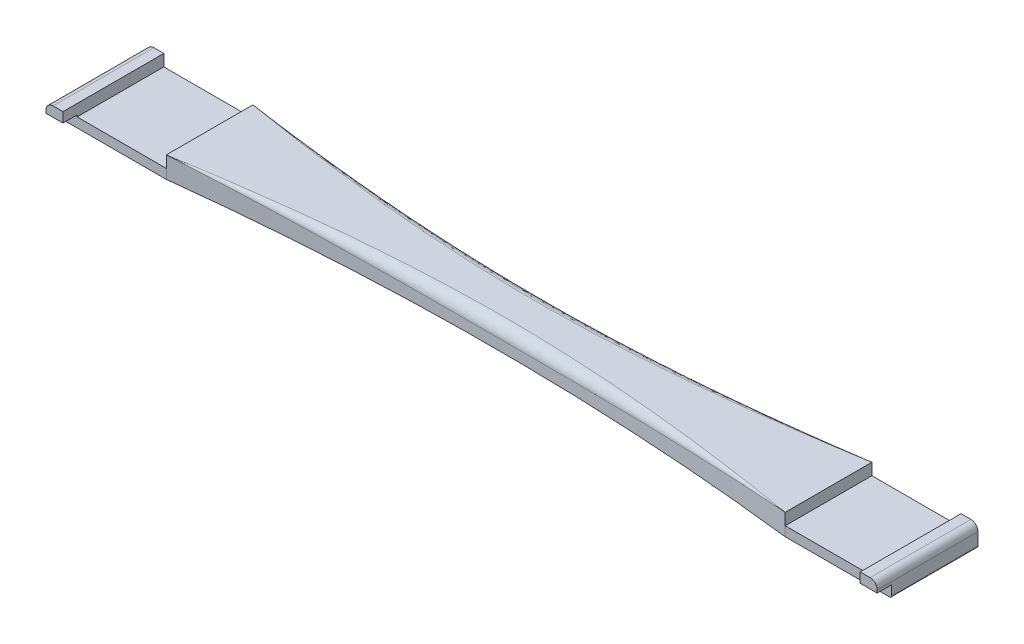
ISO-10303-21;
HEADER;
FILE_DESCRIPTION(('STEP AP214'),'2;1');
FILE_NAME('part.step','',(''),(''),'','','');
FILE_SCHEMA(('AUTOMOTIVE_DESIGN { 1 0 10303 214 1 1 1 1 }'));
ENDSEC;
DATA;
#1=APPLICATION_CONTEXT('core data for automotive mechanical design processes');
#2=APPLICATION_PROTOCOL_DEFINITION('international standard','automotive_design',2000,#1);
#3=PRODUCT_CONTEXT('',#1,'mechanical');
#4=PRODUCT('Part','Part','',(#3));
#5=PRODUCT_RELATED_PRODUCT_CATEGORY('part','',(#4));
#6=PRODUCT_DEFINITION_FORMATION('','',#4);
#7=PRODUCT_DEFINITION_CONTEXT('part definition',#1,'design');
#8=PRODUCT_DEFINITION('design','',#6,#7);
#9=PRODUCT_DEFINITION_SHAPE('','',#8);
#10=(LENGTH_UNIT() NAMED_UNIT(*) SI_UNIT(.MILLI.,.METRE.));
#11=(NAMED_UNIT(*) PLANE_ANGLE_UNIT() SI_UNIT($,.RADIAN.));
#12=(NAMED_UNIT(*) SI_UNIT($,.STERADIAN.) SOLID_ANGLE_UNIT());
#13=UNCERTAINTY_MEASURE_WITH_UNIT(LENGTH_MEASURE(1.E-05),#10,'distance_accuracy_value','');
#14=(GEOMETRIC_REPRESENTATION_CONTEXT(3) GLOBAL_UNCERTAINTY_ASSIGNED_CONTEXT((#13)) GLOBAL_UNIT_ASSIGNED_CONTEXT((#10,
#11,#12)) REPRESENTATION_CONTEXT('',''));
#15=CARTESIAN_POINT('',(0.,0.,0.));
#16=DIRECTION('',(0.,0.,1.));
#17=DIRECTION('',(1.,0.,0.));
#18=AXIS2_PLACEMENT_3D('',#15,#16,#17);
#19=CARTESIAN_POINT('',(0.,2.7,0.));
#20=DIRECTION('',(0.,-1.,0.));
#21=DIRECTION('',(0.,0.,-1.));
#22=AXIS2_PLACEMENT_3D('',#19,#20,#21);
#23=PLANE('',#22);
#24=DIRECTION('',(0.,0.,1.));
#25=VECTOR('',#24,1.);
#26=CARTESIAN_POINT('',(112.7,2.7,-12.25));
#27=LINE('',#26,#25);
#28=CARTESIAN_POINT('',(112.7,2.7,-12.25));
#29=VERTEX_POINT('',#28);
#30=CARTESIAN_POINT('',(112.7,2.7,12.25));
#31=VERTEX_POINT('',#30);
#32=EDGE_CURVE('E556',#29,#31,#27,.T.);
#33=ORIENTED_EDGE('',*,*,#32,.F.);
#34=DIRECTION('',(-1.,0.,0.));
#35=VECTOR('',#34,1.);
#36=CARTESIAN_POINT('',(87.5,2.7,-12.25));
#37=LINE('',#36,#35);
#38=CARTESIAN_POINT('',(87.5,2.7,-12.25));
#39=VERTEX_POINT('',#38);
#40=EDGE_CURVE('E261',#29,#39,#37,.T.);
#41=ORIENTED_EDGE('',*,*,#40,.T.);
#42=DIRECTION('',(0.,0.,1.));
#43=VECTOR('',#42,1.);
#44=CARTESIAN_POINT('',(87.5,2.7,-12.25));
#45=LINE('',#44,#43);
#46=CARTESIAN_POINT('',(87.5,2.7,12.25));
#47=VERTEX_POINT('',#46);
#48=EDGE_CURVE('E264',#39,#47,#45,.T.);
#49=ORIENTED_EDGE('',*,*,#48,.T.);
#50=DIRECTION('',(1.,0.,0.));
#51=VECTOR('',#50,1.);
#52=CARTESIAN_POINT('',(87.5,2.7,12.25));
#53=LINE('',#52,#51);
#54=EDGE_CURVE('E269',#47,#31,#53,.T.);
#55=ORIENTED_EDGE('',*,*,#54,.T.);
#56=EDGE_LOOP('',(#33,#41,#49,#55));
#57=FACE_BOUND('',#56,.T.);
#58=ADVANCED_FACE('F45',(#57),#23,.F.);
#59=CARTESIAN_POINT('',(0.,2.7,0.));
#60=DIRECTION('',(0.,1.,0.));
#61=DIRECTION('',(0.,0.,1.));
#62=AXIS2_PLACEMENT_3D('',#59,#60,#61);
#63=PLANE('',#62);
#64=DIRECTION('',(-1.,0.,0.));
#65=VECTOR('',#64,1.);
#66=CARTESIAN_POINT('',(-87.5000000000001,2.7,-12.25));
#67=LINE('',#66,#65);
#68=CARTESIAN_POINT('',(-87.5000000000001,2.7,-12.25));
#69=VERTEX_POINT('',#68);
#70=CARTESIAN_POINT('',(-112.7,2.7,-12.25));
#71=VERTEX_POINT('',#70);
#72=EDGE_CURVE('E233',#69,#71,#67,.T.);
#73=ORIENTED_EDGE('',*,*,#72,.T.);
#74=DIRECTION('',(0.,0.,1.));
#75=VECTOR('',#74,1.);
#76=CARTESIAN_POINT('',(-112.7,2.7,0.));
#77=LINE('',#76,#75);
#78=CARTESIAN_POINT('',(-112.7,2.7,12.25));
#79=VERTEX_POINT('',#78);
#80=EDGE_CURVE('E302',#71,#79,#77,.T.);
#81=ORIENTED_EDGE('',*,*,#80,.T.);
#82=DIRECTION('',(1.,0.,0.));
#83=VECTOR('',#82,1.);
#84=CARTESIAN_POINT('',(-87.5000000000001,2.7,12.25));
#85=LINE('',#84,#83);
#86=CARTESIAN_POINT('',(-87.5000000000001,2.7,12.25));
#87=VERTEX_POINT('',#86);
#88=EDGE_CURVE('E236',#79,#87,#85,.T.);
#89=ORIENTED_EDGE('',*,*,#88,.T.);
#90=DIRECTION('',(0.,0.,-1.));
#91=VECTOR('',#90,1.);
#92=CARTESIAN_POINT('',(-87.5000000000001,2.7,-12.25));
#93=LINE('',#92,#91);
#94=EDGE_CURVE('E240',#87,#69,#93,.T.);
#95=ORIENTED_EDGE('',*,*,#94,.T.);
#96=EDGE_LOOP('',(#73,#81,#89,#95));
#97=FACE_BOUND('',#96,.T.);
#98=ADVANCED_FACE('F405',(#97),#63,.T.);
#99=CARTESIAN_POINT('',(87.5,6.,12.25));
#100=DIRECTION('',(-1.,0.,0.));
#101=DIRECTION('',(0.,0.,1.));
#102=AXIS2_PLACEMENT_3D('',#99,#100,#101);
#103=PLANE('',#102);
#104=ORIENTED_EDGE('',*,*,#48,.F.);
#105=DIRECTION('',(0.,-1.,0.));
#106=VECTOR('',#105,1.);
#107=CARTESIAN_POINT('',(87.5,6.,-12.25));
#108=LINE('',#107,#106);
#109=CARTESIAN_POINT('',(87.5,6.,-12.25));
#110=VERTEX_POINT('',#109);
#111=EDGE_CURVE('E379',#110,#39,#108,.T.);
#112=ORIENTED_EDGE('',*,*,#111,.F.);
#113=DIRECTION('',(0.,0.,-1.));
#114=VECTOR('',#113,1.);
#115=CARTESIAN_POINT('',(87.5,6.,12.25));
#116=LINE('',#115,#114);
#117=CARTESIAN_POINT('',(87.5,6.,12.25));
#118=VERTEX_POINT('',#117);
#119=EDGE_CURVE('E342',#118,#110,#116,.T.);
#120=ORIENTED_EDGE('',*,*,#119,.F.);
#121=DIRECTION('',(0.,-1.,0.));
#122=VECTOR('',#121,1.);
#123=CARTESIAN_POINT('',(87.5,6.,12.25));
#124=LINE('',#123,#122);
#125=EDGE_CURVE('E374',#118,#47,#124,.T.);
#126=ORIENTED_EDGE('',*,*,#125,.T.);
#127=EDGE_LOOP('',(#104,#112,#120,#126));
#128=FACE_BOUND('',#127,.T.);
#129=ADVANCED_FACE('F402',(#128),#103,.F.);
#130=CARTESIAN_POINT('',(-87.5,6.,12.25));
#131=DIRECTION('',(-1.,0.,0.));
#132=DIRECTION('',(0.,0.,1.));
#133=AXIS2_PLACEMENT_3D('',#130,#131,#132);
#134=PLANE('',#133);
#135=ORIENTED_EDGE('',*,*,#94,.F.);
#136=DIRECTION('',(0.,-1.,0.));
#137=VECTOR('',#136,1.);
#138=CARTESIAN_POINT('',(-87.5000000000001,6.,12.25));
#139=LINE('',#138,#137);
#140=CARTESIAN_POINT('',(-87.5000000000001,6.,12.25));
#141=VERTEX_POINT('',#140);
#142=EDGE_CURVE('E307',#141,#87,#139,.T.);
#143=ORIENTED_EDGE('',*,*,#142,.F.);
#144=DIRECTION('',(0.,0.,-1.));
#145=VECTOR('',#144,1.);
#146=CARTESIAN_POINT('',(-87.5,6.,12.25));
#147=LINE('',#146,#145);
#148=CARTESIAN_POINT('',(-87.5000000000001,6.,-12.25));
#149=VERTEX_POINT('',#148);
#150=EDGE_CURVE('E301',#141,#149,#147,.T.);
#151=ORIENTED_EDGE('',*,*,#150,.T.);
#152=DIRECTION('',(0.,-1.,0.));
#153=VECTOR('',#152,1.);
#154=CARTESIAN_POINT('',(-87.5000000000001,6.,-12.25));
#155=LINE('',#154,#153);
#156=EDGE_CURVE('E883',#149,#69,#155,.T.);
#157=ORIENTED_EDGE('',*,*,#156,.T.);
#158=EDGE_LOOP('',(#135,#143,#151,#157));
#159=FACE_BOUND('',#158,.T.);
#160=ADVANCED_FACE('F401',(#159),#134,.T.);
#161=CARTESIAN_POINT('',(0.,6.,757.128345771979));
#162=DIRECTION('',(0.,-1.,0.));
#163=DIRECTION('',(0.,0.,-1.));
#164=AXIS2_PLACEMENT_3D('',#161,#162,#163);
#165=CYLINDRICAL_SURFACE('',#164,750.);
#166=ORIENTED_EDGE('',*,*,#125,.F.);
#167=CARTESIAN_POINT('',(-87.5000000000001,6.,12.25));
#168=CARTESIAN_POINT('',(-72.983193556157,5.24999993309472,10.5447274933602));
#169=CARTESIAN_POINT('',(-58.4165276942769,4.49999999996609,9.26394972299534));
#170=CARTESIAN_POINT('',(-36.5290600631975,3.65625000001708,7.98280639575663));
#171=CARTESIAN_POINT('',(-29.2269951686637,3.42187499998212,7.66240648600781));
#172=CARTESIAN_POINT('',(-14.6166200938381,3.09375000001833,7.2351761715188));
#173=CARTESIAN_POINT('',(-7.30831009206505,2.99999999999861,7.12834577197894));
#174=CARTESIAN_POINT('',(7.30831009207044,3.00000000000178,7.12834577197899));
#175=CARTESIAN_POINT('',(14.6166200938449,3.09375000001824,7.23517617151894));
#176=CARTESIAN_POINT('',(29.2269951686486,3.42187499998203,7.66240648600722));
#177=CARTESIAN_POINT('',(36.5290600632156,3.65625000001718,7.98280639575762));
#178=CARTESIAN_POINT('',(58.4165276942484,4.49999999996619,9.26394972299367));
#179=CARTESIAN_POINT('',(72.9831935561807,5.24999993310629,10.544727493363));
#180=CARTESIAN_POINT('',(87.5,6.,12.25));
#181=(BOUNDED_CURVE() B_SPLINE_CURVE(3,(#167,#168,#169,#170,#171,#172,#173,#174,#175,#176,#177,
#178,#179,#180),.UNSPECIFIED.,.F.,.F.) B_SPLINE_CURVE_WITH_KNOTS((4,2,2,2,2,2,4),
(6.16625234571721,6.2247188264484,6.25395206681399,6.28318530717959,6.31241854754518,
6.34165178791078,6.40011826864196),
.UNSPECIFIED.) CURVE() GEOMETRIC_REPRESENTATION_ITEM() RATIONAL_B_SPLINE_CURVE((0.999999999999973,
0.999999999999973,0.999999999999973,0.999999999999973,0.999999999999973,0.999999999999973,
0.999999999999973,0.999999999999973,0.999999999999973,0.999999999999973,0.999999999999973,
0.999999999999973,0.999999999999973,0.999999999999973)) REPRESENTATION_ITEM(''));
#182=EDGE_CURVE('E385',#118,#141,#181,.F.);
#183=ORIENTED_EDGE('',*,*,#182,.T.);
#184=ORIENTED_EDGE('',*,*,#142,.T.);
#185=DIRECTION('',(0.,-1.,0.));
#186=VECTOR('',#185,1.);
#187=CARTESIAN_POINT('',(-87.5000000000001,2.7,12.25));
#188=LINE('',#187,#186);
#189=CARTESIAN_POINT('',(-87.5000000000001,0.,12.25));
#190=VERTEX_POINT('',#189);
#191=EDGE_CURVE('E250',#87,#190,#188,.T.);
#192=ORIENTED_EDGE('',*,*,#191,.T.);
#193=CARTESIAN_POINT('',(0.,0.,757.128345771979));
#194=DIRECTION('',(0.,-1.,0.));
#195=DIRECTION('',(0.,0.,-1.));
#196=AXIS2_PLACEMENT_3D('',#193,#194,#195);
#197=CIRCLE('',#196,750.);
#198=CARTESIAN_POINT('',(87.5,0.,12.25));
#199=VERTEX_POINT('',#198);
#200=EDGE_CURVE('E298',#190,#199,#197,.T.);
#201=ORIENTED_EDGE('',*,*,#200,.T.);
#202=DIRECTION('',(0.,-1.,0.));
#203=VECTOR('',#202,1.);
#204=CARTESIAN_POINT('',(87.5,2.7,12.25));
#205=LINE('',#204,#203);
#206=EDGE_CURVE('E286',#47,#199,#205,.T.);
#207=ORIENTED_EDGE('',*,*,#206,.F.);
#208=EDGE_LOOP('',(#166,#183,#184,#192,#201,#207));
#209=FACE_BOUND('',#208,.T.);
#210=ADVANCED_FACE('F392',(#209),#165,.F.);
#211=CARTESIAN_POINT('',(0.,6.,-757.128345771979));
#212=DIRECTION('',(0.,-1.,0.));
#213=DIRECTION('',(0.,0.,-1.));
#214=AXIS2_PLACEMENT_3D('',#211,#212,#213);
#215=CYLINDRICAL_SURFACE('',#214,750.);
#216=ORIENTED_EDGE('',*,*,#156,.F.);
#217=CARTESIAN_POINT('',(87.5,6.,-12.25));
#218=CARTESIAN_POINT('',(72.9831935561489,5.24999993299477,-10.5447274933593));
#219=CARTESIAN_POINT('',(58.4165276942991,4.49999999996609,-9.26394972299604));
#220=CARTESIAN_POINT('',(36.5290600631904,3.65625000001703,-7.98280639575645));
#221=CARTESIAN_POINT('',(29.2269951686362,3.42187499998186,-7.66240648600662));
#222=CARTESIAN_POINT('',(14.6166200938575,3.09375000001805,-7.23517617151955));
#223=CARTESIAN_POINT('',(7.30831009139927,3.00000000000158,-7.12834577197876));
#224=CARTESIAN_POINT('',(-7.3083100913937,2.99999999999842,-7.12834577197916));
#225=CARTESIAN_POINT('',(-14.6166200938379,3.09375000001814,-7.23517617151806));
#226=CARTESIAN_POINT('',(-29.2269951686634,3.42187499998195,-7.66240648600853));
#227=CARTESIAN_POINT('',(-36.529060063223,3.65625000001693,-7.98280639575713));
#228=CARTESIAN_POINT('',(-58.4165276942253,4.49999999996599,-9.26394972299427));
#229=CARTESIAN_POINT('',(-72.9831935561799,5.24999993338415,-10.5447274933629));
#230=CARTESIAN_POINT('',(-87.5000000000001,6.,-12.25));
#231=(BOUNDED_CURVE() B_SPLINE_CURVE(3,(#217,#218,#219,#220,#221,#222,#223,#224,#225,#226,#227,
#228,#229,#230),.UNSPECIFIED.,.F.,.F.) B_SPLINE_CURVE_WITH_KNOTS((4,2,2,2,2,2,4),
(6.16625234571721,6.2247188264484,6.25395206681399,6.28318530717959,6.31241854754518,
6.34165178791078,6.40011826864196),
.UNSPECIFIED.) CURVE() GEOMETRIC_REPRESENTATION_ITEM() RATIONAL_B_SPLINE_CURVE((1.,1.,1.,1.,1.,
1.,1.,1.,1.,1.,1.,1.,1.,1.)) REPRESENTATION_ITEM(''));
#232=EDGE_CURVE('E487',#149,#110,#231,.F.);
#233=ORIENTED_EDGE('',*,*,#232,.T.);
#234=ORIENTED_EDGE('',*,*,#111,.T.);
#235=DIRECTION('',(0.,-1.,0.));
#236=VECTOR('',#235,1.);
#237=CARTESIAN_POINT('',(87.5,2.7,-12.25));
#238=LINE('',#237,#236);
#239=CARTESIAN_POINT('',(87.5,0.,-12.25));
#240=VERTEX_POINT('',#239);
#241=EDGE_CURVE('E290',#39,#240,#238,.T.);
#242=ORIENTED_EDGE('',*,*,#241,.T.);
#243=CARTESIAN_POINT('',(0.,0.,-757.128345771979));
#244=DIRECTION('',(0.,1.,0.));
#245=DIRECTION('',(0.,0.,1.));
#246=AXIS2_PLACEMENT_3D('',#243,#244,#245);
#247=CIRCLE('',#246,750.);
#248=CARTESIAN_POINT('',(-87.5000000000001,0.,-12.25));
#249=VERTEX_POINT('',#248);
#250=EDGE_CURVE('E294',#249,#240,#247,.T.);
#251=ORIENTED_EDGE('',*,*,#250,.F.);
#252=DIRECTION('',(0.,-1.,0.));
#253=VECTOR('',#252,1.);
#254=CARTESIAN_POINT('',(-87.5000000000001,2.7,-12.25));
#255=LINE('',#254,#253);
#256=EDGE_CURVE('E243',#69,#249,#255,.T.);
#257=ORIENTED_EDGE('',*,*,#256,.F.);
#258=EDGE_LOOP('',(#216,#233,#234,#242,#251,#257));
#259=FACE_BOUND('',#258,.T.);
#260=ADVANCED_FACE('F355',(#259),#215,.F.);
#261=CARTESIAN_POINT('',(0.,6.,-757.128345771979));
#262=DIRECTION('',(0.,1.,0.));
#263=DIRECTION('',(0.,0.,1.));
#264=AXIS2_PLACEMENT_3D('',#261,#262,#263);
#265=PLANE('',#264);
#266=ORIENTED_EDGE('',*,*,#150,.F.);
#267=CARTESIAN_POINT('',(87.5,6.,12.25));
#268=CARTESIAN_POINT('',(73.0720434443471,6.,9.80007829553897));
#269=CARTESIAN_POINT('',(58.5443044834947,6.00000000000002,7.76886150223446));
#270=CARTESIAN_POINT('',(36.6459493093459,5.99999999999999,5.6418867282853));
#271=CARTESIAN_POINT('',(29.3290609742949,5.99999999999999,5.08616404855593));
#272=CARTESIAN_POINT('',(14.6748575065022,6.00000000000001,4.32938686710422));
#273=CARTESIAN_POINT('',(7.33754333243302,6.,4.12834577197896));
#274=CARTESIAN_POINT('',(-7.33754333242761,6.,4.12834577197896));
#275=CARTESIAN_POINT('',(-14.674857506481,5.99999999999999,4.32938686791583));
#276=CARTESIAN_POINT('',(-29.3290609743243,6.00000000000001,5.08616404774477));
#277=CARTESIAN_POINT('',(-36.6459493093433,5.99999999999999,5.64188672828507));
#278=CARTESIAN_POINT('',(-58.5443044834922,6.00000000000003,7.76886150223423));
#279=CARTESIAN_POINT('',(-73.0720434443517,6.,9.80007829550529));
#280=CARTESIAN_POINT('',(-87.5000000000001,6.,12.25));
#281=(BOUNDED_CURVE() B_SPLINE_CURVE(3,(#267,#268,#269,#270,#271,#272,#273,#274,#275,#276,#277,
#278,#279,#280),.UNSPECIFIED.,.F.,.F.) B_SPLINE_CURVE_WITH_KNOTS((4,2,2,2,2,2,4),
(6.16625234571721,6.2247188264484,6.25395206681399,6.28318530717959,6.31241854754518,
6.34165178791078,6.40011826864196),
.UNSPECIFIED.) CURVE() GEOMETRIC_REPRESENTATION_ITEM() RATIONAL_B_SPLINE_CURVE((1.,1.,1.,1.,1.,
1.,1.,1.,1.,1.,1.,1.,1.,1.)) REPRESENTATION_ITEM(''));
#282=EDGE_CURVE('E423',#141,#118,#281,.F.);
#283=ORIENTED_EDGE('',*,*,#282,.T.);
#284=ORIENTED_EDGE('',*,*,#119,.T.);
#285=CARTESIAN_POINT('',(-87.5000000000001,6.,-12.25));
#286=CARTESIAN_POINT('',(-73.0720434443517,6.,-9.80007829550534));
#287=CARTESIAN_POINT('',(-58.5443044834922,6.00000000000003,-7.76886150223433));
#288=CARTESIAN_POINT('',(-36.6459493093433,5.99999999999999,-5.64188672828523));
#289=CARTESIAN_POINT('',(-29.3290609743243,6.00000000000001,-5.08616404774494));
#290=CARTESIAN_POINT('',(-14.674857506481,5.99999999999999,-4.32938686791602));
#291=CARTESIAN_POINT('',(-7.33754333242761,6.,-4.12834577197916));
#292=CARTESIAN_POINT('',(7.33754333243302,6.,-4.12834577197916));
#293=CARTESIAN_POINT('',(14.6748575065022,6.00000000000001,-4.32938686710441));
#294=CARTESIAN_POINT('',(29.3290609742948,5.99999999999999,-5.0861640485561));
#295=CARTESIAN_POINT('',(36.6459493093459,5.99999999999999,-5.64188672828545));
#296=CARTESIAN_POINT('',(58.5443044834947,6.00000000000002,-7.76886150223455));
#297=CARTESIAN_POINT('',(73.0720434443471,6.,-9.80007829553902));
#298=CARTESIAN_POINT('',(87.5,6.,-12.25));
#299=(BOUNDED_CURVE() B_SPLINE_CURVE(3,(#285,#286,#287,#288,#289,#290,#291,#292,#293,#294,#295,
#296,#297,#298),.UNSPECIFIED.,.F.,.F.) B_SPLINE_CURVE_WITH_KNOTS((4,2,2,2,2,2,4),
(6.16625234571721,6.2247188264484,6.25395206681399,6.28318530717959,6.31241854754518,
6.34165178791078,6.40011826864196),
.UNSPECIFIED.) CURVE() GEOMETRIC_REPRESENTATION_ITEM() RATIONAL_B_SPLINE_CURVE((0.999999999999973,
0.999999999999973,0.999999999999973,0.999999999999973,0.999999999999973,0.999999999999973,
0.999999999999973,0.999999999999973,0.999999999999973,0.999999999999973,0.999999999999973,
0.999999999999973,0.999999999999973,0.999999999999973)) REPRESENTATION_ITEM(''));
#300=EDGE_CURVE('E332',#110,#149,#299,.F.);
#301=ORIENTED_EDGE('',*,*,#300,.T.);
#302=EDGE_LOOP('',(#266,#283,#284,#301));
#303=FACE_BOUND('',#302,.T.);
#304=ADVANCED_FACE('F344',(#303),#265,.T.);
#305=CARTESIAN_POINT('',(0.,0.,-757.128345771979));
#306=DIRECTION('',(0.,1.,0.));
#307=DIRECTION('',(0.,0.,1.));
#308=AXIS2_PLACEMENT_3D('',#305,#306,#307);
#309=PLANE('',#308);
#310=DIRECTION('',(1.,0.,0.));
#311=VECTOR('',#310,1.);
#312=CARTESIAN_POINT('',(-87.5000000000001,0.,12.25));
#313=LINE('',#312,#311);
#314=CARTESIAN_POINT('',(-117.,0.,12.25));
#315=VERTEX_POINT('',#314);
#316=EDGE_CURVE('E227',#315,#190,#313,.T.);
#317=ORIENTED_EDGE('',*,*,#316,.F.);
#318=DIRECTION('',(0.,0.,1.));
#319=VECTOR('',#318,1.);
#320=CARTESIAN_POINT('',(-117.,0.,-757.128345771979));
#321=LINE('',#320,#319);
#322=CARTESIAN_POINT('',(-117.,0.,-12.25));
#323=VERTEX_POINT('',#322);
#324=EDGE_CURVE('E514',#315,#323,#321,.F.);
#325=ORIENTED_EDGE('',*,*,#324,.T.);
#326=DIRECTION('',(-1.,0.,0.));
#327=VECTOR('',#326,1.);
#328=CARTESIAN_POINT('',(-87.5000000000001,0.,-12.25));
#329=LINE('',#328,#327);
#330=EDGE_CURVE('E221',#249,#323,#329,.T.);
#331=ORIENTED_EDGE('',*,*,#330,.F.);
#332=ORIENTED_EDGE('',*,*,#250,.T.);
#333=DIRECTION('',(-1.,0.,0.));
#334=VECTOR('',#333,1.);
#335=CARTESIAN_POINT('',(87.5,0.,-12.25));
#336=LINE('',#335,#334);
#337=CARTESIAN_POINT('',(117.,0.,-12.25));
#338=VERTEX_POINT('',#337);
#339=EDGE_CURVE('E260',#338,#240,#336,.T.);
#340=ORIENTED_EDGE('',*,*,#339,.F.);
#341=DIRECTION('',(0.,0.,-1.));
#342=VECTOR('',#341,1.);
#343=CARTESIAN_POINT('',(117.,0.,-757.128345771979));
#344=LINE('',#343,#342);
#345=CARTESIAN_POINT('',(117.,0.,12.25));
#346=VERTEX_POINT('',#345);
#347=EDGE_CURVE('E511',#338,#346,#344,.F.);
#348=ORIENTED_EDGE('',*,*,#347,.T.);
#349=DIRECTION('',(1.,0.,0.));
#350=VECTOR('',#349,1.);
#351=CARTESIAN_POINT('',(87.5,0.,12.25));
#352=LINE('',#351,#350);
#353=EDGE_CURVE('E265',#199,#346,#352,.T.);
#354=ORIENTED_EDGE('',*,*,#353,.F.);
#355=ORIENTED_EDGE('',*,*,#200,.F.);
#356=EDGE_LOOP('',(#317,#325,#331,#332,#340,#348,#354,#355));
#357=FACE_BOUND('',#356,.T.);
#358=ADVANCED_FACE('F354',(#357),#309,.F.);
#359=CARTESIAN_POINT('',(87.5,2.7,-12.25));
#360=DIRECTION('',(0.,0.,1.));
#361=DIRECTION('',(1.,0.,0.));
#362=AXIS2_PLACEMENT_3D('',#359,#360,#361);
#363=PLANE('',#362);
#364=DIRECTION('',(0.,-1.,0.));
#365=VECTOR('',#364,1.);
#366=CARTESIAN_POINT('',(117.5,2.7,-12.25));
#367=LINE('',#366,#365);
#368=CARTESIAN_POINT('',(117.5,4.,-12.25));
#369=VERTEX_POINT('',#368);
#370=CARTESIAN_POINT('',(117.5,0.500000000000001,-12.25));
#371=VERTEX_POINT('',#370);
#372=EDGE_CURVE('E273',#369,#371,#367,.T.);
#373=ORIENTED_EDGE('',*,*,#372,.T.);
#374=CARTESIAN_POINT('',(117.,0.5,-12.25));
#375=DIRECTION('',(0.,0.,1.));
#376=DIRECTION('',(1.,0.,0.));
#377=AXIS2_PLACEMENT_3D('',#374,#375,#376);
#378=CIRCLE('',#377,0.5);
#379=EDGE_CURVE('E524',#371,#338,#378,.F.);
#380=ORIENTED_EDGE('',*,*,#379,.T.);
#381=ORIENTED_EDGE('',*,*,#339,.T.);
#382=ORIENTED_EDGE('',*,*,#241,.F.);
#383=ORIENTED_EDGE('',*,*,#40,.F.);
#384=DIRECTION('',(0.,-1.,0.));
#385=VECTOR('',#384,1.);
#386=CARTESIAN_POINT('',(112.7,6.,-12.25));
#387=LINE('',#386,#385);
#388=CARTESIAN_POINT('',(112.7,6.,-12.25));
#389=VERTEX_POINT('',#388);
#390=EDGE_CURVE('E550',#389,#29,#387,.T.);
#391=ORIENTED_EDGE('',*,*,#390,.F.);
#392=DIRECTION('',(-1.,0.,0.));
#393=VECTOR('',#392,1.);
#394=CARTESIAN_POINT('',(117.5,6.,-12.25));
#395=LINE('',#394,#393);
#396=CARTESIAN_POINT('',(115.5,6.,-12.25));
#397=VERTEX_POINT('',#396);
#398=EDGE_CURVE('E605',#397,#389,#395,.T.);
#399=ORIENTED_EDGE('',*,*,#398,.F.);
#400=CARTESIAN_POINT('',(115.5,4.,-12.25));
#401=DIRECTION('',(0.,0.,1.));
#402=DIRECTION('',(1.,0.,0.));
#403=AXIS2_PLACEMENT_3D('',#400,#401,#402);
#404=CIRCLE('',#403,2.);
#405=EDGE_CURVE('E323',#397,#369,#404,.F.);
#406=ORIENTED_EDGE('',*,*,#405,.T.);
#407=EDGE_LOOP('',(#373,#380,#381,#382,#383,#391,#399,#406));
#408=FACE_BOUND('',#407,.T.);
#409=ADVANCED_FACE('F356',(#408),#363,.F.);
#410=CARTESIAN_POINT('',(87.5,2.7,12.25));
#411=DIRECTION('',(0.,0.,-1.));
#412=DIRECTION('',(-1.,0.,0.));
#413=AXIS2_PLACEMENT_3D('',#410,#411,#412);
#414=PLANE('',#413);
#415=ORIENTED_EDGE('',*,*,#353,.T.);
#416=CARTESIAN_POINT('',(117.,0.5,12.25));
#417=DIRECTION('',(0.,0.,-1.));
#418=DIRECTION('',(-1.,0.,0.));
#419=AXIS2_PLACEMENT_3D('',#416,#417,#418);
#420=CIRCLE('',#419,0.5);
#421=CARTESIAN_POINT('',(117.5,0.500000000000001,12.25));
#422=VERTEX_POINT('',#421);
#423=EDGE_CURVE('E527',#346,#422,#420,.F.);
#424=ORIENTED_EDGE('',*,*,#423,.T.);
#425=DIRECTION('',(0.,-1.,0.));
#426=VECTOR('',#425,1.);
#427=CARTESIAN_POINT('',(117.5,2.7,12.25));
#428=LINE('',#427,#426);
#429=CARTESIAN_POINT('',(117.5,3.2,12.25));
#430=VERTEX_POINT('',#429);
#431=EDGE_CURVE('E282',#430,#422,#428,.T.);
#432=ORIENTED_EDGE('',*,*,#431,.F.);
#433=DIRECTION('',(1.,0.,0.));
#434=VECTOR('',#433,1.);
#435=CARTESIAN_POINT('',(-117.5,3.2,12.25));
#436=LINE('',#435,#434);
#437=CARTESIAN_POINT('',(112.7,3.2,12.25));
#438=VERTEX_POINT('',#437);
#439=EDGE_CURVE('E623',#438,#430,#436,.T.);
#440=ORIENTED_EDGE('',*,*,#439,.F.);
#441=DIRECTION('',(0.,1.,0.));
#442=VECTOR('',#441,1.);
#443=CARTESIAN_POINT('',(112.7,6.,12.25));
#444=LINE('',#443,#442);
#445=EDGE_CURVE('E12',#31,#438,#444,.T.);
#446=ORIENTED_EDGE('',*,*,#445,.F.);
#447=ORIENTED_EDGE('',*,*,#54,.F.);
#448=ORIENTED_EDGE('',*,*,#206,.T.);
#449=EDGE_LOOP('',(#415,#424,#432,#440,#446,#447,#448));
#450=FACE_BOUND('',#449,.T.);
#451=ADVANCED_FACE('F598',(#450),#414,.F.);
#452=CARTESIAN_POINT('',(117.5,2.7,-12.25));
#453=DIRECTION('',(-1.,0.,0.));
#454=DIRECTION('',(0.,0.,1.));
#455=AXIS2_PLACEMENT_3D('',#452,#453,#454);
#456=PLANE('',#455);
#457=DIRECTION('',(0.,0.,1.));
#458=VECTOR('',#457,1.);
#459=CARTESIAN_POINT('',(117.5,3.2,12.25));
#460=LINE('',#459,#458);
#461=CARTESIAN_POINT('',(117.5,3.2,16.25));
#462=VERTEX_POINT('',#461);
#463=EDGE_CURVE('E69',#430,#462,#460,.T.);
#464=ORIENTED_EDGE('',*,*,#463,.F.);
#465=ORIENTED_EDGE('',*,*,#431,.T.);
#466=DIRECTION('',(0.,0.,-1.));
#467=VECTOR('',#466,1.);
#468=CARTESIAN_POINT('',(117.5,0.5,-12.25));
#469=LINE('',#468,#467);
#470=EDGE_CURVE('E520',#422,#371,#469,.T.);
#471=ORIENTED_EDGE('',*,*,#470,.T.);
#472=ORIENTED_EDGE('',*,*,#372,.F.);
#473=DIRECTION('',(0.,0.,-1.));
#474=VECTOR('',#473,1.);
#475=CARTESIAN_POINT('',(117.5,4.,-12.25));
#476=LINE('',#475,#474);
#477=CARTESIAN_POINT('',(117.5,4.,16.25));
#478=VERTEX_POINT('',#477);
#479=EDGE_CURVE('E326',#369,#478,#476,.F.);
#480=ORIENTED_EDGE('',*,*,#479,.T.);
#481=DIRECTION('',(0.,-1.,0.));
#482=VECTOR('',#481,1.);
#483=CARTESIAN_POINT('',(117.5,6.,16.25));
#484=LINE('',#483,#482);
#485=EDGE_CURVE('E535',#478,#462,#484,.T.);
#486=ORIENTED_EDGE('',*,*,#485,.T.);
#487=EDGE_LOOP('',(#464,#465,#471,#472,#480,#486));
#488=FACE_BOUND('',#487,.T.);
#489=ADVANCED_FACE('F542',(#488),#456,.F.);
#490=CARTESIAN_POINT('',(-87.5000000000001,2.7,-12.25));
#491=DIRECTION('',(0.,0.,1.));
#492=DIRECTION('',(1.,0.,0.));
#493=AXIS2_PLACEMENT_3D('',#490,#491,#492);
#494=PLANE('',#493);
#495=ORIENTED_EDGE('',*,*,#330,.T.);
#496=CARTESIAN_POINT('',(-117.,0.5,-12.25));
#497=DIRECTION('',(0.,0.,1.));
#498=DIRECTION('',(1.,0.,0.));
#499=AXIS2_PLACEMENT_3D('',#496,#497,#498);
#500=CIRCLE('',#499,0.5);
#501=CARTESIAN_POINT('',(-117.5,0.500000000000001,-12.25));
#502=VERTEX_POINT('',#501);
#503=EDGE_CURVE('E517',#323,#502,#500,.F.);
#504=ORIENTED_EDGE('',*,*,#503,.T.);
#505=DIRECTION('',(0.,-1.,0.));
#506=VECTOR('',#505,1.);
#507=CARTESIAN_POINT('',(-117.5,2.7,-12.25));
#508=LINE('',#507,#506);
#509=CARTESIAN_POINT('',(-117.5,4.,-12.25));
#510=VERTEX_POINT('',#509);
#511=EDGE_CURVE('E256',#510,#502,#508,.T.);
#512=ORIENTED_EDGE('',*,*,#511,.F.);
#513=CARTESIAN_POINT('',(-115.5,4.,-12.25));
#514=DIRECTION('',(0.,0.,1.));
#515=DIRECTION('',(1.,0.,0.));
#516=AXIS2_PLACEMENT_3D('',#513,#514,#515);
#517=CIRCLE('',#516,2.);
#518=CARTESIAN_POINT('',(-115.5,6.,-12.25));
#519=VERTEX_POINT('',#518);
#520=EDGE_CURVE('E316',#510,#519,#517,.F.);
#521=ORIENTED_EDGE('',*,*,#520,.T.);
#522=DIRECTION('',(-1.,0.,0.));
#523=VECTOR('',#522,1.);
#524=CARTESIAN_POINT('',(-117.5,6.,-12.25));
#525=LINE('',#524,#523);
#526=CARTESIAN_POINT('',(-112.7,6.,-12.25));
#527=VERTEX_POINT('',#526);
#528=EDGE_CURVE('E567',#527,#519,#525,.T.);
#529=ORIENTED_EDGE('',*,*,#528,.F.);
#530=DIRECTION('',(0.,-1.,0.));
#531=VECTOR('',#530,1.);
#532=CARTESIAN_POINT('',(-112.7,6.,-12.25));
#533=LINE('',#532,#531);
#534=EDGE_CURVE('E229',#527,#71,#533,.T.);
#535=ORIENTED_EDGE('',*,*,#534,.T.);
#536=ORIENTED_EDGE('',*,*,#72,.F.);
#537=ORIENTED_EDGE('',*,*,#256,.T.);
#538=EDGE_LOOP('',(#495,#504,#512,#521,#529,#535,#536,#537));
#539=FACE_BOUND('',#538,.T.);
#540=ADVANCED_FACE('F576',(#539),#494,.F.);
#541=CARTESIAN_POINT('',(-117.5,2.7,-12.25));
#542=DIRECTION('',(1.,0.,0.));
#543=DIRECTION('',(0.,0.,-1.));
#544=AXIS2_PLACEMENT_3D('',#541,#542,#543);
#545=PLANE('',#544);
#546=DIRECTION('',(0.,-1.,0.));
#547=VECTOR('',#546,1.);
#548=CARTESIAN_POINT('',(-117.5,2.7,12.25));
#549=LINE('',#548,#547);
#550=CARTESIAN_POINT('',(-117.5,3.2,12.25));
#551=VERTEX_POINT('',#550);
#552=CARTESIAN_POINT('',(-117.5,0.500000000000001,12.25));
#553=VERTEX_POINT('',#552);
#554=EDGE_CURVE('E214',#551,#553,#549,.T.);
#555=ORIENTED_EDGE('',*,*,#554,.F.);
#556=DIRECTION('',(0.,0.,1.));
#557=VECTOR('',#556,1.);
#558=CARTESIAN_POINT('',(-117.5,3.2,12.25));
#559=LINE('',#558,#557);
#560=CARTESIAN_POINT('',(-117.5,3.2,16.25));
#561=VERTEX_POINT('',#560);
#562=EDGE_CURVE('E198',#551,#561,#559,.T.);
#563=ORIENTED_EDGE('',*,*,#562,.T.);
#564=DIRECTION('',(0.,-1.,0.));
#565=VECTOR('',#564,1.);
#566=CARTESIAN_POINT('',(-117.5,6.,16.25));
#567=LINE('',#566,#565);
#568=CARTESIAN_POINT('',(-117.5,4.,16.25));
#569=VERTEX_POINT('',#568);
#570=EDGE_CURVE('E210',#569,#561,#567,.T.);
#571=ORIENTED_EDGE('',*,*,#570,.F.);
#572=DIRECTION('',(0.,0.,1.));
#573=VECTOR('',#572,1.);
#574=CARTESIAN_POINT('',(-117.5,4.,-12.25));
#575=LINE('',#574,#573);
#576=EDGE_CURVE('E313',#569,#510,#575,.F.);
#577=ORIENTED_EDGE('',*,*,#576,.T.);
#578=ORIENTED_EDGE('',*,*,#511,.T.);
#579=DIRECTION('',(0.,0.,1.));
#580=VECTOR('',#579,1.);
#581=CARTESIAN_POINT('',(-117.5,0.5,-12.25));
#582=LINE('',#581,#580);
#583=EDGE_CURVE('E500',#502,#553,#582,.T.);
#584=ORIENTED_EDGE('',*,*,#583,.T.);
#585=EDGE_LOOP('',(#555,#563,#571,#577,#578,#584));
#586=FACE_BOUND('',#585,.T.);
#587=ADVANCED_FACE('F209',(#586),#545,.F.);
#588=CARTESIAN_POINT('',(-87.5000000000001,2.7,12.25));
#589=DIRECTION('',(0.,0.,-1.));
#590=DIRECTION('',(-1.,0.,0.));
#591=AXIS2_PLACEMENT_3D('',#588,#589,#590);
#592=PLANE('',#591);
#593=ORIENTED_EDGE('',*,*,#554,.T.);
#594=CARTESIAN_POINT('',(-117.,0.5,12.25));
#595=DIRECTION('',(0.,0.,-1.));
#596=DIRECTION('',(-1.,0.,0.));
#597=AXIS2_PLACEMENT_3D('',#594,#595,#596);
#598=CIRCLE('',#597,0.5);
#599=EDGE_CURVE('E508',#553,#315,#598,.F.);
#600=ORIENTED_EDGE('',*,*,#599,.T.);
#601=ORIENTED_EDGE('',*,*,#316,.T.);
#602=ORIENTED_EDGE('',*,*,#191,.F.);
#603=ORIENTED_EDGE('',*,*,#88,.F.);
#604=DIRECTION('',(0.,-1.,0.));
#605=VECTOR('',#604,1.);
#606=CARTESIAN_POINT('',(-112.7,6.,12.25));
#607=LINE('',#606,#605);
#608=CARTESIAN_POINT('',(-112.7,3.2,12.25));
#609=VERTEX_POINT('',#608);
#610=EDGE_CURVE('E581',#609,#79,#607,.T.);
#611=ORIENTED_EDGE('',*,*,#610,.F.);
#612=EDGE_CURVE('E61',#551,#609,#436,.T.);
#613=ORIENTED_EDGE('',*,*,#612,.F.);
#614=EDGE_LOOP('',(#593,#600,#601,#602,#603,#611,#613));
#615=FACE_BOUND('',#614,.T.);
#616=ADVANCED_FACE('F587',(#615),#592,.F.);
#617=CARTESIAN_POINT('',(-117.5,6.,16.25));
#618=DIRECTION('',(0.,0.,-1.));
#619=DIRECTION('',(-1.,0.,0.));
#620=AXIS2_PLACEMENT_3D('',#617,#618,#619);
#621=PLANE('',#620);
#622=ORIENTED_EDGE('',*,*,#570,.T.);
#623=DIRECTION('',(1.,0.,0.));
#624=VECTOR('',#623,1.);
#625=CARTESIAN_POINT('',(-117.5,3.2,16.25));
#626=LINE('',#625,#624);
#627=CARTESIAN_POINT('',(-112.7,3.2,16.25));
#628=VERTEX_POINT('',#627);
#629=EDGE_CURVE('E195',#561,#628,#626,.T.);
#630=ORIENTED_EDGE('',*,*,#629,.T.);
#631=DIRECTION('',(0.,-1.,0.));
#632=VECTOR('',#631,1.);
#633=CARTESIAN_POINT('',(-112.7,6.,16.25));
#634=LINE('',#633,#632);
#635=CARTESIAN_POINT('',(-112.7,6.,16.25));
#636=VERTEX_POINT('',#635);
#637=EDGE_CURVE('E222',#636,#628,#634,.T.);
#638=ORIENTED_EDGE('',*,*,#637,.F.);
#639=DIRECTION('',(1.,0.,0.));
#640=VECTOR('',#639,1.);
#641=CARTESIAN_POINT('',(-117.5,6.,16.25));
#642=LINE('',#641,#640);
#643=CARTESIAN_POINT('',(-115.5,6.,16.25));
#644=VERTEX_POINT('',#643);
#645=EDGE_CURVE('E561',#644,#636,#642,.T.);
#646=ORIENTED_EDGE('',*,*,#645,.F.);
#647=CARTESIAN_POINT('',(-115.5,4.,16.25));
#648=DIRECTION('',(0.,0.,-1.));
#649=DIRECTION('',(-1.,0.,0.));
#650=AXIS2_PLACEMENT_3D('',#647,#648,#649);
#651=CIRCLE('',#650,2.);
#652=EDGE_CURVE('E219',#644,#569,#651,.F.);
#653=ORIENTED_EDGE('',*,*,#652,.T.);
#654=EDGE_LOOP('',(#622,#630,#638,#646,#653));
#655=FACE_BOUND('',#654,.T.);
#656=ADVANCED_FACE('F217',(#655),#621,.F.);
#657=CARTESIAN_POINT('',(-112.7,6.,-12.25));
#658=DIRECTION('',(-1.,0.,0.));
#659=DIRECTION('',(0.,0.,1.));
#660=AXIS2_PLACEMENT_3D('',#657,#658,#659);
#661=PLANE('',#660);
#662=DIRECTION('',(0.,0.,-1.));
#663=VECTOR('',#662,1.);
#664=CARTESIAN_POINT('',(-112.7,3.2,-12.25));
#665=LINE('',#664,#663);
#666=EDGE_CURVE('E200',#628,#609,#665,.T.);
#667=ORIENTED_EDGE('',*,*,#666,.T.);
#668=ORIENTED_EDGE('',*,*,#610,.T.);
#669=ORIENTED_EDGE('',*,*,#80,.F.);
#670=ORIENTED_EDGE('',*,*,#534,.F.);
#671=DIRECTION('',(0.,0.,-1.));
#672=VECTOR('',#671,1.);
#673=CARTESIAN_POINT('',(-112.7,6.,-12.25));
#674=LINE('',#673,#672);
#675=EDGE_CURVE('E564',#636,#527,#674,.T.);
#676=ORIENTED_EDGE('',*,*,#675,.F.);
#677=ORIENTED_EDGE('',*,*,#637,.T.);
#678=EDGE_LOOP('',(#667,#668,#669,#670,#676,#677));
#679=FACE_BOUND('',#678,.T.);
#680=ADVANCED_FACE('F580',(#679),#661,.F.);
#681=CARTESIAN_POINT('',(0.,6.,0.));
#682=DIRECTION('',(0.,1.,0.));
#683=DIRECTION('',(0.,0.,1.));
#684=AXIS2_PLACEMENT_3D('',#681,#682,#683);
#685=PLANE('',#684);
#686=ORIENTED_EDGE('',*,*,#528,.T.);
#687=DIRECTION('',(0.,0.,1.));
#688=VECTOR('',#687,1.);
#689=CARTESIAN_POINT('',(-115.5,6.,16.25));
#690=LINE('',#689,#688);
#691=EDGE_CURVE('E306',#519,#644,#690,.T.);
#692=ORIENTED_EDGE('',*,*,#691,.T.);
#693=ORIENTED_EDGE('',*,*,#645,.T.);
#694=ORIENTED_EDGE('',*,*,#675,.T.);
#695=EDGE_LOOP('',(#686,#692,#693,#694));
#696=FACE_BOUND('',#695,.T.);
#697=ADVANCED_FACE('F649',(#696),#685,.T.);
#698=CARTESIAN_POINT('',(112.7,6.,-12.25));
#699=DIRECTION('',(1.,0.,0.));
#700=DIRECTION('',(0.,0.,-1.));
#701=AXIS2_PLACEMENT_3D('',#698,#699,#700);
#702=PLANE('',#701);
#703=ORIENTED_EDGE('',*,*,#32,.T.);
#704=ORIENTED_EDGE('',*,*,#445,.T.);
#705=DIRECTION('',(0.,0.,1.));
#706=VECTOR('',#705,1.);
#707=CARTESIAN_POINT('',(112.7,3.2,-12.25));
#708=LINE('',#707,#706);
#709=CARTESIAN_POINT('',(112.7,3.2,16.25));
#710=VERTEX_POINT('',#709);
#711=EDGE_CURVE('E616',#438,#710,#708,.T.);
#712=ORIENTED_EDGE('',*,*,#711,.T.);
#713=DIRECTION('',(0.,-1.,0.));
#714=VECTOR('',#713,1.);
#715=CARTESIAN_POINT('',(112.7,6.,16.25));
#716=LINE('',#715,#714);
#717=CARTESIAN_POINT('',(112.7,6.,16.25));
#718=VERTEX_POINT('',#717);
#719=EDGE_CURVE('E539',#718,#710,#716,.T.);
#720=ORIENTED_EDGE('',*,*,#719,.F.);
#721=DIRECTION('',(0.,0.,1.));
#722=VECTOR('',#721,1.);
#723=CARTESIAN_POINT('',(112.7,6.,-12.25));
#724=LINE('',#723,#722);
#725=EDGE_CURVE('E553',#389,#718,#724,.T.);
#726=ORIENTED_EDGE('',*,*,#725,.F.);
#727=ORIENTED_EDGE('',*,*,#390,.T.);
#728=EDGE_LOOP('',(#703,#704,#712,#720,#726,#727));
#729=FACE_BOUND('',#728,.T.);
#730=ADVANCED_FACE('F615',(#729),#702,.F.);
#731=CARTESIAN_POINT('',(117.5,6.,16.25));
#732=DIRECTION('',(0.,0.,-1.));
#733=DIRECTION('',(-1.,0.,0.));
#734=AXIS2_PLACEMENT_3D('',#731,#732,#733);
#735=PLANE('',#734);
#736=ORIENTED_EDGE('',*,*,#719,.T.);
#737=DIRECTION('',(1.,0.,0.));
#738=VECTOR('',#737,1.);
#739=CARTESIAN_POINT('',(117.5,3.2,16.25));
#740=LINE('',#739,#738);
#741=EDGE_CURVE('E54',#710,#462,#740,.T.);
#742=ORIENTED_EDGE('',*,*,#741,.T.);
#743=ORIENTED_EDGE('',*,*,#485,.F.);
#744=CARTESIAN_POINT('',(115.5,4.,16.25));
#745=DIRECTION('',(0.,0.,-1.));
#746=DIRECTION('',(-1.,0.,0.));
#747=AXIS2_PLACEMENT_3D('',#744,#745,#746);
#748=CIRCLE('',#747,2.);
#749=CARTESIAN_POINT('',(115.5,6.,16.25));
#750=VERTEX_POINT('',#749);
#751=EDGE_CURVE('E329',#478,#750,#748,.F.);
#752=ORIENTED_EDGE('',*,*,#751,.T.);
#753=DIRECTION('',(1.,0.,0.));
#754=VECTOR('',#753,1.);
#755=CARTESIAN_POINT('',(117.5,6.,16.25));
#756=LINE('',#755,#754);
#757=EDGE_CURVE('E546',#718,#750,#756,.T.);
#758=ORIENTED_EDGE('',*,*,#757,.F.);
#759=EDGE_LOOP('',(#736,#742,#743,#752,#758));
#760=FACE_BOUND('',#759,.T.);
#761=ADVANCED_FACE('F534',(#760),#735,.F.);
#762=CARTESIAN_POINT('',(0.,6.,0.));
#763=DIRECTION('',(0.,-1.,0.));
#764=DIRECTION('',(0.,0.,-1.));
#765=AXIS2_PLACEMENT_3D('',#762,#763,#764);
#766=PLANE('',#765);
#767=ORIENTED_EDGE('',*,*,#757,.T.);
#768=DIRECTION('',(0.,0.,-1.));
#769=VECTOR('',#768,1.);
#770=CARTESIAN_POINT('',(115.5,6.,0.));
#771=LINE('',#770,#769);
#772=EDGE_CURVE('E319',#750,#397,#771,.T.);
#773=ORIENTED_EDGE('',*,*,#772,.T.);
#774=ORIENTED_EDGE('',*,*,#398,.T.);
#775=ORIENTED_EDGE('',*,*,#725,.T.);
#776=EDGE_LOOP('',(#767,#773,#774,#775));
#777=FACE_BOUND('',#776,.T.);
#778=ADVANCED_FACE('F609',(#777),#766,.F.);
#779=CARTESIAN_POINT('',(-115.5,4.,0.));
#780=DIRECTION('',(0.,0.,-1.));
#781=DIRECTION('',(-1.,0.,0.));
#782=AXIS2_PLACEMENT_3D('',#779,#780,#781);
#783=CYLINDRICAL_SURFACE('',#782,2.);
#784=ORIENTED_EDGE('',*,*,#520,.F.);
#785=ORIENTED_EDGE('',*,*,#576,.F.);
#786=ORIENTED_EDGE('',*,*,#652,.F.);
#787=ORIENTED_EDGE('',*,*,#691,.F.);
#788=EDGE_LOOP('',(#784,#785,#786,#787));
#789=FACE_BOUND('',#788,.T.);
#790=ADVANCED_FACE('F647',(#789),#783,.T.);
#791=CARTESIAN_POINT('',(115.5,4.,0.));
#792=DIRECTION('',(0.,0.,-1.));
#793=DIRECTION('',(-1.,0.,0.));
#794=AXIS2_PLACEMENT_3D('',#791,#792,#793);
#795=CYLINDRICAL_SURFACE('',#794,2.);
#796=ORIENTED_EDGE('',*,*,#751,.F.);
#797=ORIENTED_EDGE('',*,*,#479,.F.);
#798=ORIENTED_EDGE('',*,*,#405,.F.);
#799=ORIENTED_EDGE('',*,*,#772,.F.);
#800=EDGE_LOOP('',(#796,#797,#798,#799));
#801=FACE_BOUND('',#800,.T.);
#802=ADVANCED_FACE('F444',(#801),#795,.T.);
#803=CARTESIAN_POINT('',(-87.5000000000001,6.,12.25));
#804=CARTESIAN_POINT('',(-73.0720434443517,6.,9.80007829550529));
#805=CARTESIAN_POINT('',(-58.5443044834922,6.00000000000003,7.76886150223423));
#806=CARTESIAN_POINT('',(-36.6459493093433,5.99999999999999,5.64188672828507));
#807=CARTESIAN_POINT('',(-29.3290609743243,6.00000000000001,5.08616404774477));
#808=CARTESIAN_POINT('',(-14.674857506481,5.99999999999999,4.32938686791583));
#809=CARTESIAN_POINT('',(-7.33754333242761,6.,4.12834577197896));
#810=CARTESIAN_POINT('',(7.33754333243302,6.,4.12834577197896));
#811=CARTESIAN_POINT('',(14.6748575065022,6.00000000000001,4.32938686710422));
#812=CARTESIAN_POINT('',(29.3290609742949,5.99999999999999,5.08616404855593));
#813=CARTESIAN_POINT('',(36.6459493093459,5.99999999999999,5.6418867282853));
#814=CARTESIAN_POINT('',(58.5443044834947,6.00000000000002,7.76886150223446));
#815=CARTESIAN_POINT('',(73.0720434443471,6.,9.80007829553897));
#816=CARTESIAN_POINT('',(87.5,6.,12.25));
#817=CARTESIAN_POINT('',(-87.5000000000001,6.,12.25));
#818=CARTESIAN_POINT('',(-72.9831935528779,5.99999999922665,10.5447274917344));
#819=CARTESIAN_POINT('',(-58.4165276942607,6.00000000057688,9.26394972327308));
#820=CARTESIAN_POINT('',(-36.5290600632057,5.99999999971162,7.98280639561775));
#821=CARTESIAN_POINT('',(-29.2269951686799,6.0000000001395,7.66240648588535));
#822=CARTESIAN_POINT('',(-14.6166200938219,5.99999999986059,7.23517617164126));
#823=CARTESIAN_POINT('',(-7.30831009206505,5.99999999999366,7.12834577197896));
#824=CARTESIAN_POINT('',(7.30831009207044,6.00000000000634,7.12834577197896));
#825=CARTESIAN_POINT('',(14.6166200938558,6.00000000017427,7.2351761711466));
#826=CARTESIAN_POINT('',(29.2269951686378,5.99999999982563,7.66240648637956));
#827=CARTESIAN_POINT('',(36.5290600632082,5.99999999997468,7.9828063958841));
#828=CARTESIAN_POINT('',(58.4165276942632,6.00000000005074,9.26394972274072));
#829=CARTESIAN_POINT('',(72.9831935529228,5.99999999922665,10.5447274917635));
#830=CARTESIAN_POINT('',(87.5,6.,12.25));
#831=CARTESIAN_POINT('',(-87.5000000000001,6.,12.25));
#832=CARTESIAN_POINT('',(-72.983193556157,5.24999993309467,10.5447274933602));
#833=CARTESIAN_POINT('',(-58.4165276942769,4.49999999996599,9.26394972299533));
#834=CARTESIAN_POINT('',(-36.5290600631975,3.65625000001693,7.98280639575663));
#835=CARTESIAN_POINT('',(-29.2269951686637,3.42187499998195,7.66240648600781));
#836=CARTESIAN_POINT('',(-14.6166200938381,3.09375000001814,7.2351761715188));
#837=CARTESIAN_POINT('',(-7.30831009206505,2.99999999999842,7.12834577197894));
#838=CARTESIAN_POINT('',(7.30831009207044,3.00000000000158,7.12834577197899));
#839=CARTESIAN_POINT('',(14.6166200938449,3.09375000001805,7.23517617151894));
#840=CARTESIAN_POINT('',(29.2269951686486,3.42187499998186,7.66240648600722));
#841=CARTESIAN_POINT('',(36.5290600632156,3.65625000001703,7.98280639575762));
#842=CARTESIAN_POINT('',(58.4165276942484,4.49999999996609,9.26394972299367));
#843=CARTESIAN_POINT('',(72.9831935561807,5.24999993310624,10.544727493363));
#844=CARTESIAN_POINT('',(87.5,6.,12.25));
#845=(BOUNDED_SURFACE() B_SPLINE_SURFACE(2,3,((#803,#804,#805,#806,#807,#808,#809,#810,#811,
#812,#813,#814,#815,#816),(#817,#818,#819,#820,#821,#822,#823,#824,#825,#826,#827,#828,#829,
#830),(#831,#832,#833,#834,#835,#836,#837,#838,#839,#840,#841,#842,#843,#844)),.UNSPECIFIED.,
.F.,.F.,.F.) B_SPLINE_SURFACE_WITH_KNOTS((3,3),(4,2,2,2,2,2,4),(0.,1.),(6.16625234571721,
6.2247188264484,6.25395206681399,6.28318530717959,6.31241854754518,6.34165178791078,
6.40011826864196),.UNSPECIFIED.) GEOMETRIC_REPRESENTATION_ITEM() RATIONAL_B_SPLINE_SURFACE(((1.,
1.,1.,1.,1.,1.,1.,1.,1.,1.,1.,1.,1.,1.),(0.707106781186548,0.707106781186559,0.707106781186541,
0.707106781186541,0.707106781186542,0.707106781186542,0.707106781186547,0.707106781186547,
0.707106781186553,0.707106781186553,0.707106781186542,0.707106781186542,0.707106781186561,
0.707106781186548),(1.,1.,1.,1.,1.,1.,1.,1.,1.,1.,1.,1.,1.,1.))) REPRESENTATION_ITEM('') SURFACE());
#846=ORIENTED_EDGE('',*,*,#282,.F.);
#847=ORIENTED_EDGE('',*,*,#182,.F.);
#848=EDGE_LOOP('',(#846,#847));
#849=FACE_BOUND('',#848,.T.);
#850=ADVANCED_FACE('F429',(#849),#845,.T.);
#851=CARTESIAN_POINT('',(-87.5000000000001,6.,-12.25));
#852=CARTESIAN_POINT('',(-72.9831935561799,5.24999993338415,-10.5447274933629));
#853=CARTESIAN_POINT('',(-58.4165276942253,4.49999999996599,-9.26394972299427));
#854=CARTESIAN_POINT('',(-36.529060063223,3.65625000001693,-7.98280639575713));
#855=CARTESIAN_POINT('',(-29.2269951686634,3.42187499998195,-7.66240648600853));
#856=CARTESIAN_POINT('',(-14.6166200938379,3.09375000001814,-7.23517617151806));
#857=CARTESIAN_POINT('',(-7.3083100913937,2.99999999999842,-7.12834577197916));
#858=CARTESIAN_POINT('',(7.30831009139927,3.00000000000158,-7.12834577197876));
#859=CARTESIAN_POINT('',(14.6166200938575,3.09375000001805,-7.23517617151955));
#860=CARTESIAN_POINT('',(29.2269951686362,3.42187499998186,-7.66240648600662));
#861=CARTESIAN_POINT('',(36.5290600631904,3.65625000001703,-7.98280639575645));
#862=CARTESIAN_POINT('',(58.4165276942991,4.49999999996609,-9.26394972299604));
#863=CARTESIAN_POINT('',(72.9831935561489,5.24999993299477,-10.5447274933593));
#864=CARTESIAN_POINT('',(87.5,6.,-12.25));
#865=CARTESIAN_POINT('',(-87.5000000000001,6.,-12.25));
#866=CARTESIAN_POINT('',(-72.9831935529181,5.99999999922665,-10.5447274917225));
#867=CARTESIAN_POINT('',(-58.4165276942097,6.00000000057688,-9.26394972326039));
#868=CARTESIAN_POINT('',(-36.5290600632308,5.99999999971162,-7.98280639562407));
#869=CARTESIAN_POINT('',(-29.2269951686796,6.00000000014267,-7.66240648588217));
#870=CARTESIAN_POINT('',(-14.6166200938216,5.99999999985742,-7.23517617164442));
#871=CARTESIAN_POINT('',(-7.3083100913937,5.99999999999683,-7.12834577197579));
#872=CARTESIAN_POINT('',(7.30831009139927,6.00000000000317,-7.12834577198213));
#873=CARTESIAN_POINT('',(14.6166200938686,6.00000000017427,-7.23517617114343));
#874=CARTESIAN_POINT('',(29.2269951686252,5.99999999982563,-7.66240648638273));
#875=CARTESIAN_POINT('',(36.5290600631829,5.99999999997468,-7.9828063958841));
#876=CARTESIAN_POINT('',(58.416527694314,6.00000000005074,-9.26394972274073));
#877=CARTESIAN_POINT('',(72.9831935528893,5.99999999922665,-10.5447274917249));
#878=CARTESIAN_POINT('',(87.5,6.,-12.25));
#879=CARTESIAN_POINT('',(-87.5000000000001,6.,-12.25));
#880=CARTESIAN_POINT('',(-73.0720434443517,6.,-9.80007829550529));
#881=CARTESIAN_POINT('',(-58.5443044834922,6.00000000000003,-7.76886150223423));
#882=CARTESIAN_POINT('',(-36.6459493093433,5.99999999999999,-5.64188672828507));
#883=CARTESIAN_POINT('',(-29.3290609743243,6.00000000000001,-5.08616404774477));
#884=CARTESIAN_POINT('',(-14.674857506481,5.99999999999999,-4.32938686791583));
#885=CARTESIAN_POINT('',(-7.33754333242761,6.,-4.12834577197896));
#886=CARTESIAN_POINT('',(7.33754333243302,6.,-4.12834577197896));
#887=CARTESIAN_POINT('',(14.6748575065022,6.00000000000001,-4.32938686710422));
#888=CARTESIAN_POINT('',(29.3290609742949,5.99999999999999,-5.08616404855593));
#889=CARTESIAN_POINT('',(36.6459493093459,5.99999999999999,-5.6418867282853));
#890=CARTESIAN_POINT('',(58.5443044834947,6.00000000000002,-7.76886150223446));
#891=CARTESIAN_POINT('',(73.0720434443471,6.,-9.80007829553897));
#892=CARTESIAN_POINT('',(87.5,6.,-12.25));
#893=(BOUNDED_SURFACE() B_SPLINE_SURFACE(2,3,((#851,#852,#853,#854,#855,#856,#857,#858,#859,
#860,#861,#862,#863,#864),(#865,#866,#867,#868,#869,#870,#871,#872,#873,#874,#875,#876,#877,
#878),(#879,#880,#881,#882,#883,#884,#885,#886,#887,#888,#889,#890,#891,#892)),.UNSPECIFIED.,
.F.,.F.,.F.) B_SPLINE_SURFACE_WITH_KNOTS((3,3),(4,2,2,2,2,2,4),(0.,1.),(6.16625234571721,
6.2247188264484,6.25395206681399,6.28318530717959,6.31241854754518,6.34165178791078,
6.40011826864196),.UNSPECIFIED.) GEOMETRIC_REPRESENTATION_ITEM() RATIONAL_B_SPLINE_SURFACE(((1.,
1.,1.,1.,1.,1.,1.,1.,1.,1.,1.,1.,1.,1.),(0.707106781186548,0.707106781186559,0.707106781186541,
0.707106781186541,0.707106781186542,0.707106781186542,0.707106781186547,0.707106781186547,
0.707106781186553,0.707106781186553,0.707106781186542,0.707106781186542,0.707106781186561,
0.707106781186548),(1.,1.,1.,1.,1.,1.,1.,1.,1.,1.,1.,1.,1.,1.))) REPRESENTATION_ITEM('') SURFACE());
#894=ORIENTED_EDGE('',*,*,#232,.F.);
#895=ORIENTED_EDGE('',*,*,#300,.F.);
#896=EDGE_LOOP('',(#894,#895));
#897=FACE_BOUND('',#896,.T.);
#898=ADVANCED_FACE('F443',(#897),#893,.T.);
#899=CARTESIAN_POINT('',(-117.,0.5,-12.25));
#900=DIRECTION('',(0.,0.,1.));
#901=DIRECTION('',(1.,0.,0.));
#902=AXIS2_PLACEMENT_3D('',#899,#900,#901);
#903=CYLINDRICAL_SURFACE('',#902,0.5);
#904=ORIENTED_EDGE('',*,*,#503,.F.);
#905=ORIENTED_EDGE('',*,*,#324,.F.);
#906=ORIENTED_EDGE('',*,*,#599,.F.);
#907=ORIENTED_EDGE('',*,*,#583,.F.);
#908=EDGE_LOOP('',(#904,#905,#906,#907));
#909=FACE_BOUND('',#908,.T.);
#910=ADVANCED_FACE('F643',(#909),#903,.T.);
#911=CARTESIAN_POINT('',(117.,0.5,-12.25));
#912=DIRECTION('',(0.,0.,-1.));
#913=DIRECTION('',(-1.,0.,0.));
#914=AXIS2_PLACEMENT_3D('',#911,#912,#913);
#915=CYLINDRICAL_SURFACE('',#914,0.5);
#916=ORIENTED_EDGE('',*,*,#423,.F.);
#917=ORIENTED_EDGE('',*,*,#347,.F.);
#918=ORIENTED_EDGE('',*,*,#379,.F.);
#919=ORIENTED_EDGE('',*,*,#470,.F.);
#920=EDGE_LOOP('',(#916,#917,#918,#919));
#921=FACE_BOUND('',#920,.T.);
#922=ADVANCED_FACE('F47',(#921),#915,.T.);
#923=CARTESIAN_POINT('',(0.,3.2,0.));
#924=DIRECTION('',(0.,1.,0.));
#925=DIRECTION('',(0.,0.,1.));
#926=AXIS2_PLACEMENT_3D('',#923,#924,#925);
#927=PLANE('',#926);
#928=ORIENTED_EDGE('',*,*,#439,.T.);
#929=ORIENTED_EDGE('',*,*,#463,.T.);
#930=ORIENTED_EDGE('',*,*,#741,.F.);
#931=ORIENTED_EDGE('',*,*,#711,.F.);
#932=EDGE_LOOP('',(#928,#929,#930,#931));
#933=FACE_BOUND('',#932,.T.);
#934=ADVANCED_FACE('F721',(#933),#927,.F.);
#935=ORIENTED_EDGE('',*,*,#629,.F.);
#936=ORIENTED_EDGE('',*,*,#562,.F.);
#937=ORIENTED_EDGE('',*,*,#612,.T.);
#938=ORIENTED_EDGE('',*,*,#666,.F.);
#939=EDGE_LOOP('',(#935,#936,#937,#938));
#940=FACE_BOUND('',#939,.T.);
#941=ADVANCED_FACE('F197',(#940),#927,.F.);
#942=CLOSED_SHELL('',(#58,#98,#129,#160,#210,#260,#304,#358,#409,#451,#489,#540,#587,#616,#656,
#680,#697,#730,#761,#778,#790,#802,#850,#898,#910,#922,#934,#941));
#943=MANIFOLD_SOLID_BREP('B2',#942);
#944=ADVANCED_BREP_SHAPE_REPRESENTATION('',(#18,#943),#14);
#945=SHAPE_DEFINITION_REPRESENTATION(#9,#944);
ENDSEC;
END-ISO-10303-21;
